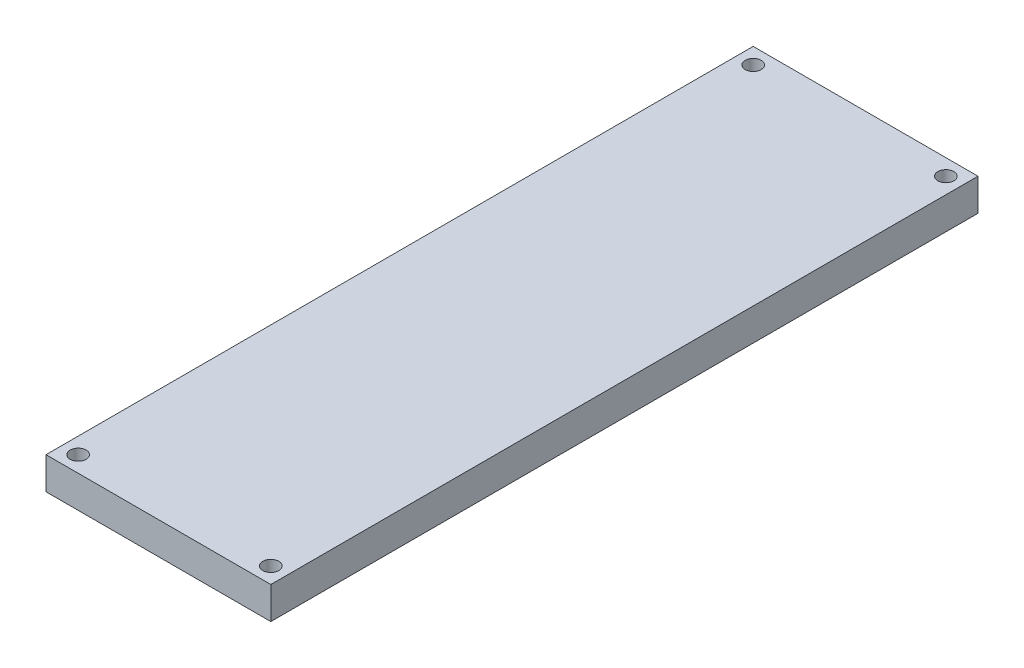
ISO-10303-21;
HEADER;
FILE_DESCRIPTION(('STEP AP214'),'2;1');
FILE_NAME('part.step','',(''),(''),'','','');
FILE_SCHEMA(('AUTOMOTIVE_DESIGN { 1 0 10303 214 1 1 1 1 }'));
ENDSEC;
DATA;
#1=APPLICATION_CONTEXT('core data for automotive mechanical design processes');
#2=APPLICATION_PROTOCOL_DEFINITION('international standard','automotive_design',2000,#1);
#3=PRODUCT_CONTEXT('',#1,'mechanical');
#4=PRODUCT('Part','Part','',(#3));
#5=PRODUCT_RELATED_PRODUCT_CATEGORY('part','',(#4));
#6=PRODUCT_DEFINITION_FORMATION('','',#4);
#7=PRODUCT_DEFINITION_CONTEXT('part definition',#1,'design');
#8=PRODUCT_DEFINITION('design','',#6,#7);
#9=PRODUCT_DEFINITION_SHAPE('','',#8);
#10=(LENGTH_UNIT() NAMED_UNIT(*) SI_UNIT(.MILLI.,.METRE.));
#11=(NAMED_UNIT(*) PLANE_ANGLE_UNIT() SI_UNIT($,.RADIAN.));
#12=(NAMED_UNIT(*) SI_UNIT($,.STERADIAN.) SOLID_ANGLE_UNIT());
#13=UNCERTAINTY_MEASURE_WITH_UNIT(LENGTH_MEASURE(1.E-05),#10,'distance_accuracy_value','');
#14=(GEOMETRIC_REPRESENTATION_CONTEXT(3) GLOBAL_UNCERTAINTY_ASSIGNED_CONTEXT((#13)) GLOBAL_UNIT_ASSIGNED_CONTEXT((#10,
#11,#12)) REPRESENTATION_CONTEXT('',''));
#15=CARTESIAN_POINT('',(0.,0.,0.));
#16=DIRECTION('',(0.,0.,1.));
#17=DIRECTION('',(1.,0.,0.));
#18=AXIS2_PLACEMENT_3D('',#15,#16,#17);
#19=CARTESIAN_POINT('',(0.,12.7,0.));
#20=DIRECTION('',(0.,-1.,0.));
#21=DIRECTION('',(0.,0.,-1.));
#22=AXIS2_PLACEMENT_3D('',#19,#20,#21);
#23=PLANE('',#22);
#24=CARTESIAN_POINT('',(-38.0636450911377,12.7,-133.35));
#25=DIRECTION('',(0.,1.,0.));
#26=DIRECTION('',(0.,0.,1.));
#27=AXIS2_PLACEMENT_3D('',#24,#25,#26);
#28=CIRCLE('',#27,3.175);
#29=CARTESIAN_POINT('',(-38.0636450911377,12.7,-130.175));
#30=VERTEX_POINT('',#29);
#31=EDGE_CURVE('E138',#30,#30,#28,.T.);
#32=ORIENTED_EDGE('',*,*,#31,.F.);
#33=EDGE_LOOP('',(#32));
#34=FACE_BOUND('',#33,.T.);
#35=CARTESIAN_POINT('',(38.0636450911377,12.7,-133.35));
#36=DIRECTION('',(0.,1.,0.));
#37=DIRECTION('',(0.,0.,1.));
#38=AXIS2_PLACEMENT_3D('',#35,#36,#37);
#39=CIRCLE('',#38,3.175);
#40=CARTESIAN_POINT('',(38.0636450911377,12.7,-130.175));
#41=VERTEX_POINT('',#40);
#42=EDGE_CURVE('E154',#41,#41,#39,.F.);
#43=ORIENTED_EDGE('',*,*,#42,.T.);
#44=EDGE_LOOP('',(#43));
#45=FACE_BOUND('',#44,.T.);
#46=CARTESIAN_POINT('',(-38.0636450911377,12.7,133.35));
#47=DIRECTION('',(0.,1.,0.));
#48=DIRECTION('',(0.,0.,1.));
#49=AXIS2_PLACEMENT_3D('',#46,#47,#48);
#50=CIRCLE('',#49,3.175);
#51=CARTESIAN_POINT('',(-38.0636450911377,12.7,136.525));
#52=VERTEX_POINT('',#51);
#53=EDGE_CURVE('E130',#52,#52,#50,.F.);
#54=ORIENTED_EDGE('',*,*,#53,.T.);
#55=EDGE_LOOP('',(#54));
#56=FACE_BOUND('',#55,.T.);
#57=DIRECTION('',(-1.,0.,0.));
#58=VECTOR('',#57,1.);
#59=CARTESIAN_POINT('',(44.4136450911377,12.7,-139.7));
#60=LINE('',#59,#58);
#61=CARTESIAN_POINT('',(44.4136450911377,12.7,-139.7));
#62=VERTEX_POINT('',#61);
#63=CARTESIAN_POINT('',(-44.4136450911377,12.7,-139.7));
#64=VERTEX_POINT('',#63);
#65=EDGE_CURVE('E92',#62,#64,#60,.T.);
#66=ORIENTED_EDGE('',*,*,#65,.T.);
#67=DIRECTION('',(0.,0.,1.));
#68=VECTOR('',#67,1.);
#69=CARTESIAN_POINT('',(-44.4136450911377,12.7,139.7));
#70=LINE('',#69,#68);
#71=CARTESIAN_POINT('',(-44.4136450911377,12.7,139.7));
#72=VERTEX_POINT('',#71);
#73=EDGE_CURVE('E87',#64,#72,#70,.T.);
#74=ORIENTED_EDGE('',*,*,#73,.T.);
#75=DIRECTION('',(1.,0.,0.));
#76=VECTOR('',#75,1.);
#77=CARTESIAN_POINT('',(44.4136450911377,12.7,139.7));
#78=LINE('',#77,#76);
#79=CARTESIAN_POINT('',(44.4136450911377,12.7,139.7));
#80=VERTEX_POINT('',#79);
#81=EDGE_CURVE('E90',#72,#80,#78,.T.);
#82=ORIENTED_EDGE('',*,*,#81,.T.);
#83=DIRECTION('',(0.,0.,-1.));
#84=VECTOR('',#83,1.);
#85=CARTESIAN_POINT('',(44.4136450911377,12.7,139.7));
#86=LINE('',#85,#84);
#87=EDGE_CURVE('E57',#80,#62,#86,.T.);
#88=ORIENTED_EDGE('',*,*,#87,.T.);
#89=EDGE_LOOP('',(#66,#74,#82,#88));
#90=FACE_BOUND('',#89,.T.);
#91=CARTESIAN_POINT('',(38.0636450911377,12.7,133.35));
#92=DIRECTION('',(0.,1.,0.));
#93=DIRECTION('',(0.,0.,1.));
#94=AXIS2_PLACEMENT_3D('',#91,#92,#93);
#95=CIRCLE('',#94,3.175);
#96=CARTESIAN_POINT('',(38.0636450911377,12.7,136.525));
#97=VERTEX_POINT('',#96);
#98=EDGE_CURVE('E147',#97,#97,#95,.T.);
#99=ORIENTED_EDGE('',*,*,#98,.F.);
#100=EDGE_LOOP('',(#99));
#101=FACE_BOUND('',#100,.T.);
#102=ADVANCED_FACE('F39',(#34,#45,#56,#90,#101),#23,.F.);
#103=CARTESIAN_POINT('',(0.,0.,0.));
#104=DIRECTION('',(0.,-1.,0.));
#105=DIRECTION('',(0.,0.,-1.));
#106=AXIS2_PLACEMENT_3D('',#103,#104,#105);
#107=PLANE('',#106);
#108=CARTESIAN_POINT('',(38.0636450911377,0.,-133.35));
#109=DIRECTION('',(0.,1.,0.));
#110=DIRECTION('',(0.,0.,1.));
#111=AXIS2_PLACEMENT_3D('',#108,#109,#110);
#112=CIRCLE('',#111,3.175);
#113=CARTESIAN_POINT('',(38.0636450911377,0.,-130.175));
#114=VERTEX_POINT('',#113);
#115=EDGE_CURVE('E143',#114,#114,#112,.F.);
#116=ORIENTED_EDGE('',*,*,#115,.F.);
#117=EDGE_LOOP('',(#116));
#118=FACE_BOUND('',#117,.T.);
#119=CARTESIAN_POINT('',(-38.0636450911377,0.,133.35));
#120=DIRECTION('',(0.,1.,0.));
#121=DIRECTION('',(0.,0.,1.));
#122=AXIS2_PLACEMENT_3D('',#119,#120,#121);
#123=CIRCLE('',#122,3.175);
#124=CARTESIAN_POINT('',(-38.0636450911377,0.,136.525));
#125=VERTEX_POINT('',#124);
#126=EDGE_CURVE('E112',#125,#125,#123,.F.);
#127=ORIENTED_EDGE('',*,*,#126,.F.);
#128=EDGE_LOOP('',(#127));
#129=FACE_BOUND('',#128,.T.);
#130=DIRECTION('',(-1.,0.,0.));
#131=VECTOR('',#130,1.);
#132=CARTESIAN_POINT('',(44.4136450911377,0.,-139.7));
#133=LINE('',#132,#131);
#134=CARTESIAN_POINT('',(44.4136450911377,0.,-139.7));
#135=VERTEX_POINT('',#134);
#136=CARTESIAN_POINT('',(-44.4136450911377,0.,-139.7));
#137=VERTEX_POINT('',#136);
#138=EDGE_CURVE('E108',#135,#137,#133,.T.);
#139=ORIENTED_EDGE('',*,*,#138,.F.);
#140=DIRECTION('',(0.,0.,-1.));
#141=VECTOR('',#140,1.);
#142=CARTESIAN_POINT('',(44.4136450911377,0.,139.7));
#143=LINE('',#142,#141);
#144=CARTESIAN_POINT('',(44.4136450911377,0.,139.7));
#145=VERTEX_POINT('',#144);
#146=EDGE_CURVE('E80',#145,#135,#143,.T.);
#147=ORIENTED_EDGE('',*,*,#146,.F.);
#148=DIRECTION('',(1.,0.,0.));
#149=VECTOR('',#148,1.);
#150=CARTESIAN_POINT('',(44.4136450911377,0.,139.7));
#151=LINE('',#150,#149);
#152=CARTESIAN_POINT('',(-44.4136450911377,0.,139.7));
#153=VERTEX_POINT('',#152);
#154=EDGE_CURVE('E74',#153,#145,#151,.T.);
#155=ORIENTED_EDGE('',*,*,#154,.F.);
#156=DIRECTION('',(0.,0.,1.));
#157=VECTOR('',#156,1.);
#158=CARTESIAN_POINT('',(-44.4136450911377,0.,139.7));
#159=LINE('',#158,#157);
#160=EDGE_CURVE('E97',#137,#153,#159,.T.);
#161=ORIENTED_EDGE('',*,*,#160,.F.);
#162=EDGE_LOOP('',(#139,#147,#155,#161));
#163=FACE_BOUND('',#162,.T.);
#164=CARTESIAN_POINT('',(-38.0636450911377,0.,-133.35));
#165=DIRECTION('',(0.,1.,0.));
#166=DIRECTION('',(0.,0.,1.));
#167=AXIS2_PLACEMENT_3D('',#164,#165,#166);
#168=CIRCLE('',#167,3.175);
#169=CARTESIAN_POINT('',(-38.0636450911377,0.,-130.175));
#170=VERTEX_POINT('',#169);
#171=EDGE_CURVE('E142',#170,#170,#168,.T.);
#172=ORIENTED_EDGE('',*,*,#171,.T.);
#173=EDGE_LOOP('',(#172));
#174=FACE_BOUND('',#173,.T.);
#175=CARTESIAN_POINT('',(38.0636450911377,0.,133.35));
#176=DIRECTION('',(0.,1.,0.));
#177=DIRECTION('',(0.,0.,1.));
#178=AXIS2_PLACEMENT_3D('',#175,#176,#177);
#179=CIRCLE('',#178,3.175);
#180=CARTESIAN_POINT('',(38.0636450911377,0.,136.525));
#181=VERTEX_POINT('',#180);
#182=EDGE_CURVE('E134',#181,#181,#179,.T.);
#183=ORIENTED_EDGE('',*,*,#182,.T.);
#184=EDGE_LOOP('',(#183));
#185=FACE_BOUND('',#184,.T.);
#186=ADVANCED_FACE('F125',(#118,#129,#163,#174,#185),#107,.T.);
#187=CARTESIAN_POINT('',(44.4136450911377,12.7,-139.7));
#188=DIRECTION('',(0.,0.,1.));
#189=DIRECTION('',(1.,0.,0.));
#190=AXIS2_PLACEMENT_3D('',#187,#188,#189);
#191=PLANE('',#190);
#192=ORIENTED_EDGE('',*,*,#138,.T.);
#193=DIRECTION('',(0.,-1.,0.));
#194=VECTOR('',#193,1.);
#195=CARTESIAN_POINT('',(-44.4136450911377,12.7,-139.7));
#196=LINE('',#195,#194);
#197=EDGE_CURVE('E11',#64,#137,#196,.T.);
#198=ORIENTED_EDGE('',*,*,#197,.F.);
#199=ORIENTED_EDGE('',*,*,#65,.F.);
#200=DIRECTION('',(0.,-1.,0.));
#201=VECTOR('',#200,1.);
#202=CARTESIAN_POINT('',(44.4136450911377,12.7,-139.7));
#203=LINE('',#202,#201);
#204=EDGE_CURVE('E104',#62,#135,#203,.T.);
#205=ORIENTED_EDGE('',*,*,#204,.T.);
#206=EDGE_LOOP('',(#192,#198,#199,#205));
#207=FACE_BOUND('',#206,.T.);
#208=ADVANCED_FACE('F41',(#207),#191,.F.);
#209=CARTESIAN_POINT('',(-44.4136450911377,12.7,139.7));
#210=DIRECTION('',(1.,0.,0.));
#211=DIRECTION('',(0.,0.,-1.));
#212=AXIS2_PLACEMENT_3D('',#209,#210,#211);
#213=PLANE('',#212);
#214=ORIENTED_EDGE('',*,*,#160,.T.);
#215=DIRECTION('',(0.,-1.,0.));
#216=VECTOR('',#215,1.);
#217=CARTESIAN_POINT('',(-44.4136450911377,12.7,139.7));
#218=LINE('',#217,#216);
#219=EDGE_CURVE('E49',#72,#153,#218,.T.);
#220=ORIENTED_EDGE('',*,*,#219,.F.);
#221=ORIENTED_EDGE('',*,*,#73,.F.);
#222=ORIENTED_EDGE('',*,*,#197,.T.);
#223=EDGE_LOOP('',(#214,#220,#221,#222));
#224=FACE_BOUND('',#223,.T.);
#225=ADVANCED_FACE('F96',(#224),#213,.F.);
#226=CARTESIAN_POINT('',(44.4136450911377,12.7,139.7));
#227=DIRECTION('',(0.,0.,-1.));
#228=DIRECTION('',(-1.,0.,0.));
#229=AXIS2_PLACEMENT_3D('',#226,#227,#228);
#230=PLANE('',#229);
#231=ORIENTED_EDGE('',*,*,#154,.T.);
#232=DIRECTION('',(0.,-1.,0.));
#233=VECTOR('',#232,1.);
#234=CARTESIAN_POINT('',(44.4136450911377,12.7,139.7));
#235=LINE('',#234,#233);
#236=EDGE_CURVE('E99',#80,#145,#235,.T.);
#237=ORIENTED_EDGE('',*,*,#236,.F.);
#238=ORIENTED_EDGE('',*,*,#81,.F.);
#239=ORIENTED_EDGE('',*,*,#219,.T.);
#240=EDGE_LOOP('',(#231,#237,#238,#239));
#241=FACE_BOUND('',#240,.T.);
#242=ADVANCED_FACE('F100',(#241),#230,.F.);
#243=CARTESIAN_POINT('',(44.4136450911377,12.7,139.7));
#244=DIRECTION('',(-1.,0.,0.));
#245=DIRECTION('',(0.,0.,1.));
#246=AXIS2_PLACEMENT_3D('',#243,#244,#245);
#247=PLANE('',#246);
#248=ORIENTED_EDGE('',*,*,#146,.T.);
#249=ORIENTED_EDGE('',*,*,#204,.F.);
#250=ORIENTED_EDGE('',*,*,#87,.F.);
#251=ORIENTED_EDGE('',*,*,#236,.T.);
#252=EDGE_LOOP('',(#248,#249,#250,#251));
#253=FACE_BOUND('',#252,.T.);
#254=ADVANCED_FACE('F122',(#253),#247,.F.);
#255=CARTESIAN_POINT('',(-38.0636450911377,0.,133.35));
#256=DIRECTION('',(0.,1.,0.));
#257=DIRECTION('',(0.,0.,1.));
#258=AXIS2_PLACEMENT_3D('',#255,#256,#257);
#259=CYLINDRICAL_SURFACE('',#258,3.175);
#260=ORIENTED_EDGE('',*,*,#126,.T.);
#261=EDGE_LOOP('',(#260));
#262=FACE_BOUND('',#261,.T.);
#263=ORIENTED_EDGE('',*,*,#53,.F.);
#264=EDGE_LOOP('',(#263));
#265=FACE_BOUND('',#264,.T.);
#266=ADVANCED_FACE('F170',(#262,#265),#259,.F.);
#267=CARTESIAN_POINT('',(38.0636450911377,0.,-133.35));
#268=DIRECTION('',(0.,1.,0.));
#269=DIRECTION('',(0.,0.,1.));
#270=AXIS2_PLACEMENT_3D('',#267,#268,#269);
#271=CYLINDRICAL_SURFACE('',#270,3.175);
#272=ORIENTED_EDGE('',*,*,#115,.T.);
#273=EDGE_LOOP('',(#272));
#274=FACE_BOUND('',#273,.T.);
#275=ORIENTED_EDGE('',*,*,#42,.F.);
#276=EDGE_LOOP('',(#275));
#277=FACE_BOUND('',#276,.T.);
#278=ADVANCED_FACE('F162',(#274,#277),#271,.F.);
#279=CARTESIAN_POINT('',(-38.0636450911377,0.,-133.35));
#280=DIRECTION('',(0.,1.,0.));
#281=DIRECTION('',(0.,0.,1.));
#282=AXIS2_PLACEMENT_3D('',#279,#280,#281);
#283=CYLINDRICAL_SURFACE('',#282,3.175);
#284=ORIENTED_EDGE('',*,*,#171,.F.);
#285=EDGE_LOOP('',(#284));
#286=FACE_BOUND('',#285,.T.);
#287=ORIENTED_EDGE('',*,*,#31,.T.);
#288=EDGE_LOOP('',(#287));
#289=FACE_BOUND('',#288,.T.);
#290=ADVANCED_FACE('F217',(#286,#289),#283,.F.);
#291=CARTESIAN_POINT('',(38.0636450911377,0.,133.35));
#292=DIRECTION('',(0.,1.,0.));
#293=DIRECTION('',(0.,0.,1.));
#294=AXIS2_PLACEMENT_3D('',#291,#292,#293);
#295=CYLINDRICAL_SURFACE('',#294,3.175);
#296=ORIENTED_EDGE('',*,*,#182,.F.);
#297=EDGE_LOOP('',(#296));
#298=FACE_BOUND('',#297,.T.);
#299=ORIENTED_EDGE('',*,*,#98,.T.);
#300=EDGE_LOOP('',(#299));
#301=FACE_BOUND('',#300,.T.);
#302=ADVANCED_FACE('F226',(#298,#301),#295,.F.);
#303=CLOSED_SHELL('',(#102,#186,#208,#225,#242,#254,#266,#278,#290,#302));
#304=MANIFOLD_SOLID_BREP('B2',#303);
#305=ADVANCED_BREP_SHAPE_REPRESENTATION('',(#18,#304),#14);
#306=SHAPE_DEFINITION_REPRESENTATION(#9,#305);
ENDSEC;
END-ISO-10303-21;
